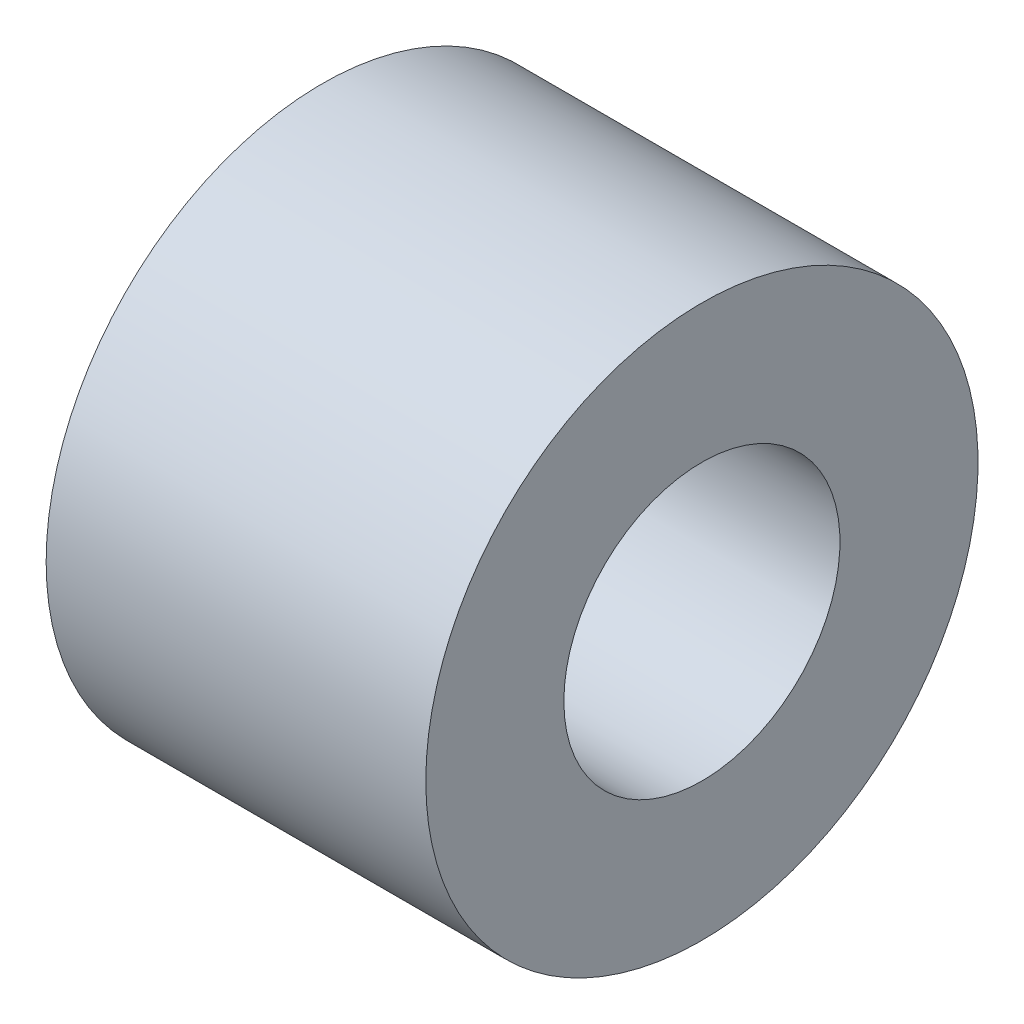
ISO-10303-21;
HEADER;
FILE_DESCRIPTION(('STEP AP214'),'2;1');
FILE_NAME('part.step','',(''),(''),'','','');
FILE_SCHEMA(('AUTOMOTIVE_DESIGN { 1 0 10303 214 1 1 1 1 }'));
ENDSEC;
DATA;
#1=APPLICATION_CONTEXT('core data for automotive mechanical design processes');
#2=APPLICATION_PROTOCOL_DEFINITION('international standard','automotive_design',2000,#1);
#3=PRODUCT_CONTEXT('',#1,'mechanical');
#4=PRODUCT('Part','Part','',(#3));
#5=PRODUCT_RELATED_PRODUCT_CATEGORY('part','',(#4));
#6=PRODUCT_DEFINITION_FORMATION('','',#4);
#7=PRODUCT_DEFINITION_CONTEXT('part definition',#1,'design');
#8=PRODUCT_DEFINITION('design','',#6,#7);
#9=PRODUCT_DEFINITION_SHAPE('','',#8);
#10=(LENGTH_UNIT() NAMED_UNIT(*) SI_UNIT(.MILLI.,.METRE.));
#11=(NAMED_UNIT(*) PLANE_ANGLE_UNIT() SI_UNIT($,.RADIAN.));
#12=(NAMED_UNIT(*) SI_UNIT($,.STERADIAN.) SOLID_ANGLE_UNIT());
#13=UNCERTAINTY_MEASURE_WITH_UNIT(LENGTH_MEASURE(1.E-05),#10,'distance_accuracy_value','');
#14=(GEOMETRIC_REPRESENTATION_CONTEXT(3) GLOBAL_UNCERTAINTY_ASSIGNED_CONTEXT((#13)) GLOBAL_UNIT_ASSIGNED_CONTEXT((#10,
#11,#12)) REPRESENTATION_CONTEXT('',''));
#15=CARTESIAN_POINT('',(0.,0.,0.));
#16=DIRECTION('',(0.,0.,1.));
#17=DIRECTION('',(1.,0.,0.));
#18=AXIS2_PLACEMENT_3D('',#15,#16,#17);
#19=CARTESIAN_POINT('',(0.,0.,0.));
#20=DIRECTION('',(-1.,0.,0.));
#21=DIRECTION('',(0.,0.,1.));
#22=AXIS2_PLACEMENT_3D('',#19,#20,#21);
#23=CYLINDRICAL_SURFACE('',#22,4.);
#24=CARTESIAN_POINT('',(5.5,0.,0.));
#25=DIRECTION('',(-1.,0.,0.));
#26=DIRECTION('',(0.,0.,1.));
#27=AXIS2_PLACEMENT_3D('',#24,#25,#26);
#28=CIRCLE('',#27,4.);
#29=CARTESIAN_POINT('',(5.5,0.,4.));
#30=VERTEX_POINT('',#29);
#31=EDGE_CURVE('E10',#30,#30,#28,.T.);
#32=ORIENTED_EDGE('',*,*,#31,.T.);
#33=EDGE_LOOP('',(#32));
#34=FACE_BOUND('',#33,.T.);
#35=CARTESIAN_POINT('',(0.,0.,0.));
#36=DIRECTION('',(-1.,0.,0.));
#37=DIRECTION('',(0.,0.,1.));
#38=AXIS2_PLACEMENT_3D('',#35,#36,#37);
#39=CIRCLE('',#38,4.);
#40=CARTESIAN_POINT('',(0.,0.,4.));
#41=VERTEX_POINT('',#40);
#42=EDGE_CURVE('E45',#41,#41,#39,.T.);
#43=ORIENTED_EDGE('',*,*,#42,.F.);
#44=EDGE_LOOP('',(#43));
#45=FACE_BOUND('',#44,.T.);
#46=ADVANCED_FACE('F31',(#34,#45),#23,.T.);
#47=CARTESIAN_POINT('',(5.5,-4.,0.));
#48=DIRECTION('',(1.,0.,0.));
#49=DIRECTION('',(0.,0.,-1.));
#50=AXIS2_PLACEMENT_3D('',#47,#48,#49);
#51=PLANE('',#50);
#52=CARTESIAN_POINT('',(5.50000000000001,0.,0.));
#53=DIRECTION('',(-1.,0.,0.));
#54=DIRECTION('',(0.,0.,1.));
#55=AXIS2_PLACEMENT_3D('',#52,#53,#54);
#56=CIRCLE('',#55,2.00000000000001);
#57=CARTESIAN_POINT('',(5.50000000000001,0.,2.00000000000001));
#58=VERTEX_POINT('',#57);
#59=EDGE_CURVE('E37',#58,#58,#56,.T.);
#60=ORIENTED_EDGE('',*,*,#59,.T.);
#61=EDGE_LOOP('',(#60));
#62=FACE_BOUND('',#61,.T.);
#63=ORIENTED_EDGE('',*,*,#31,.F.);
#64=EDGE_LOOP('',(#63));
#65=FACE_BOUND('',#64,.T.);
#66=ADVANCED_FACE('F55',(#62,#65),#51,.T.);
#67=CARTESIAN_POINT('',(0.,0.,0.));
#68=DIRECTION('',(-1.,0.,0.));
#69=DIRECTION('',(0.,0.,1.));
#70=AXIS2_PLACEMENT_3D('',#67,#68,#69);
#71=CYLINDRICAL_SURFACE('',#70,2.00000000000001);
#72=CARTESIAN_POINT('',(0.,0.,0.));
#73=DIRECTION('',(-1.,0.,0.));
#74=DIRECTION('',(0.,0.,1.));
#75=AXIS2_PLACEMENT_3D('',#72,#73,#74);
#76=CIRCLE('',#75,2.00000000000001);
#77=CARTESIAN_POINT('',(0.,0.,2.00000000000001));
#78=VERTEX_POINT('',#77);
#79=EDGE_CURVE('E41',#78,#78,#76,.T.);
#80=ORIENTED_EDGE('',*,*,#79,.T.);
#81=EDGE_LOOP('',(#80));
#82=FACE_BOUND('',#81,.T.);
#83=ORIENTED_EDGE('',*,*,#59,.F.);
#84=EDGE_LOOP('',(#83));
#85=FACE_BOUND('',#84,.T.);
#86=ADVANCED_FACE('F59',(#82,#85),#71,.F.);
#87=CARTESIAN_POINT('',(0.,-2.00000000000001,0.));
#88=DIRECTION('',(-1.,0.,0.));
#89=DIRECTION('',(0.,0.,1.));
#90=AXIS2_PLACEMENT_3D('',#87,#88,#89);
#91=PLANE('',#90);
#92=ORIENTED_EDGE('',*,*,#42,.T.);
#93=EDGE_LOOP('',(#92));
#94=FACE_BOUND('',#93,.T.);
#95=ORIENTED_EDGE('',*,*,#79,.F.);
#96=EDGE_LOOP('',(#95));
#97=FACE_BOUND('',#96,.T.);
#98=ADVANCED_FACE('F51',(#94,#97),#91,.T.);
#99=CLOSED_SHELL('',(#46,#66,#86,#98));
#100=MANIFOLD_SOLID_BREP('B2',#99);
#101=ADVANCED_BREP_SHAPE_REPRESENTATION('',(#18,#100),#14);
#102=SHAPE_DEFINITION_REPRESENTATION(#9,#101);
ENDSEC;
END-ISO-10303-21;
